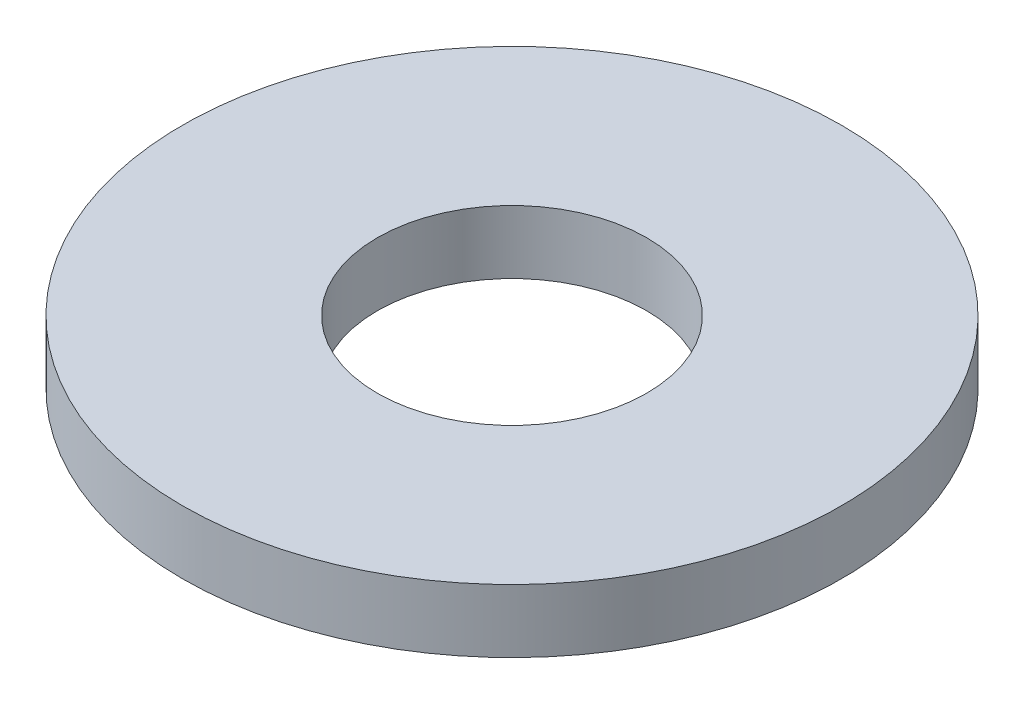
ISO-10303-21;
HEADER;
FILE_DESCRIPTION(('STEP AP214'),'2;1');
FILE_NAME('part.step','',(''),(''),'','','');
FILE_SCHEMA(('AUTOMOTIVE_DESIGN { 1 0 10303 214 1 1 1 1 }'));
ENDSEC;
DATA;
#1=APPLICATION_CONTEXT('core data for automotive mechanical design processes');
#2=APPLICATION_PROTOCOL_DEFINITION('international standard','automotive_design',2000,#1);
#3=PRODUCT_CONTEXT('',#1,'mechanical');
#4=PRODUCT('Part','Part','',(#3));
#5=PRODUCT_RELATED_PRODUCT_CATEGORY('part','',(#4));
#6=PRODUCT_DEFINITION_FORMATION('','',#4);
#7=PRODUCT_DEFINITION_CONTEXT('part definition',#1,'design');
#8=PRODUCT_DEFINITION('design','',#6,#7);
#9=PRODUCT_DEFINITION_SHAPE('','',#8);
#10=(LENGTH_UNIT() NAMED_UNIT(*) SI_UNIT(.MILLI.,.METRE.));
#11=(NAMED_UNIT(*) PLANE_ANGLE_UNIT() SI_UNIT($,.RADIAN.));
#12=(NAMED_UNIT(*) SI_UNIT($,.STERADIAN.) SOLID_ANGLE_UNIT());
#13=UNCERTAINTY_MEASURE_WITH_UNIT(LENGTH_MEASURE(1.E-05),#10,'distance_accuracy_value','');
#14=(GEOMETRIC_REPRESENTATION_CONTEXT(3) GLOBAL_UNCERTAINTY_ASSIGNED_CONTEXT((#13)) GLOBAL_UNIT_ASSIGNED_CONTEXT((#10,
#11,#12)) REPRESENTATION_CONTEXT('',''));
#15=CARTESIAN_POINT('',(0.,0.,0.));
#16=DIRECTION('',(0.,0.,1.));
#17=DIRECTION('',(1.,0.,0.));
#18=AXIS2_PLACEMENT_3D('',#15,#16,#17);
#19=CARTESIAN_POINT('',(0.,3.3528,0.));
#20=DIRECTION('',(0.,-1.,0.));
#21=DIRECTION('',(0.,0.,-1.));
#22=AXIS2_PLACEMENT_3D('',#19,#20,#21);
#23=CYLINDRICAL_SURFACE('',#22,17.4625);
#24=CARTESIAN_POINT('',(0.,3.3528,0.));
#25=DIRECTION('',(0.,1.,0.));
#26=DIRECTION('',(0.,0.,1.));
#27=AXIS2_PLACEMENT_3D('',#24,#25,#26);
#28=CIRCLE('',#27,17.4625);
#29=CARTESIAN_POINT('',(0.,3.3528,17.4625));
#30=VERTEX_POINT('',#29);
#31=EDGE_CURVE('E10',#30,#30,#28,.T.);
#32=ORIENTED_EDGE('',*,*,#31,.F.);
#33=EDGE_LOOP('',(#32));
#34=FACE_BOUND('',#33,.T.);
#35=CARTESIAN_POINT('',(0.,0.,0.));
#36=DIRECTION('',(0.,1.,0.));
#37=DIRECTION('',(0.,0.,1.));
#38=AXIS2_PLACEMENT_3D('',#35,#36,#37);
#39=CIRCLE('',#38,17.4625);
#40=CARTESIAN_POINT('',(0.,0.,17.4625));
#41=VERTEX_POINT('',#40);
#42=EDGE_CURVE('E37',#41,#41,#39,.T.);
#43=ORIENTED_EDGE('',*,*,#42,.T.);
#44=EDGE_LOOP('',(#43));
#45=FACE_BOUND('',#44,.T.);
#46=ADVANCED_FACE('F34',(#34,#45),#23,.T.);
#47=CARTESIAN_POINT('',(0.,3.3528,0.));
#48=DIRECTION('',(0.,1.,0.));
#49=DIRECTION('',(0.,0.,1.));
#50=AXIS2_PLACEMENT_3D('',#47,#48,#49);
#51=PLANE('',#50);
#52=CARTESIAN_POINT('',(0.,3.3528,0.));
#53=DIRECTION('',(0.,1.,0.));
#54=DIRECTION('',(0.,0.,1.));
#55=AXIS2_PLACEMENT_3D('',#52,#53,#54);
#56=CIRCLE('',#55,7.1374);
#57=CARTESIAN_POINT('',(0.,3.3528,7.1374));
#58=VERTEX_POINT('',#57);
#59=EDGE_CURVE('E46',#58,#58,#56,.T.);
#60=ORIENTED_EDGE('',*,*,#59,.F.);
#61=EDGE_LOOP('',(#60));
#62=FACE_BOUND('',#61,.T.);
#63=ORIENTED_EDGE('',*,*,#31,.T.);
#64=EDGE_LOOP('',(#63));
#65=FACE_BOUND('',#64,.T.);
#66=ADVANCED_FACE('F61',(#62,#65),#51,.T.);
#67=CARTESIAN_POINT('',(0.,0.,0.));
#68=DIRECTION('',(0.,1.,0.));
#69=DIRECTION('',(0.,0.,1.));
#70=AXIS2_PLACEMENT_3D('',#67,#68,#69);
#71=PLANE('',#70);
#72=CARTESIAN_POINT('',(0.,0.,0.));
#73=DIRECTION('',(0.,1.,0.));
#74=DIRECTION('',(0.,0.,1.));
#75=AXIS2_PLACEMENT_3D('',#72,#73,#74);
#76=CIRCLE('',#75,7.1374);
#77=CARTESIAN_POINT('',(0.,0.,7.1374));
#78=VERTEX_POINT('',#77);
#79=EDGE_CURVE('E44',#78,#78,#76,.T.);
#80=ORIENTED_EDGE('',*,*,#79,.T.);
#81=EDGE_LOOP('',(#80));
#82=FACE_BOUND('',#81,.T.);
#83=ORIENTED_EDGE('',*,*,#42,.F.);
#84=EDGE_LOOP('',(#83));
#85=FACE_BOUND('',#84,.T.);
#86=ADVANCED_FACE('F52',(#82,#85),#71,.F.);
#87=CARTESIAN_POINT('',(0.,0.,0.));
#88=DIRECTION('',(0.,1.,0.));
#89=DIRECTION('',(0.,0.,1.));
#90=AXIS2_PLACEMENT_3D('',#87,#88,#89);
#91=CYLINDRICAL_SURFACE('',#90,7.1374);
#92=ORIENTED_EDGE('',*,*,#79,.F.);
#93=EDGE_LOOP('',(#92));
#94=FACE_BOUND('',#93,.T.);
#95=ORIENTED_EDGE('',*,*,#59,.T.);
#96=EDGE_LOOP('',(#95));
#97=FACE_BOUND('',#96,.T.);
#98=ADVANCED_FACE('F55',(#94,#97),#91,.F.);
#99=CLOSED_SHELL('',(#46,#66,#86,#98));
#100=MANIFOLD_SOLID_BREP('B2',#99);
#101=ADVANCED_BREP_SHAPE_REPRESENTATION('',(#18,#100),#14);
#102=SHAPE_DEFINITION_REPRESENTATION(#9,#101);
ENDSEC;
END-ISO-10303-21;
